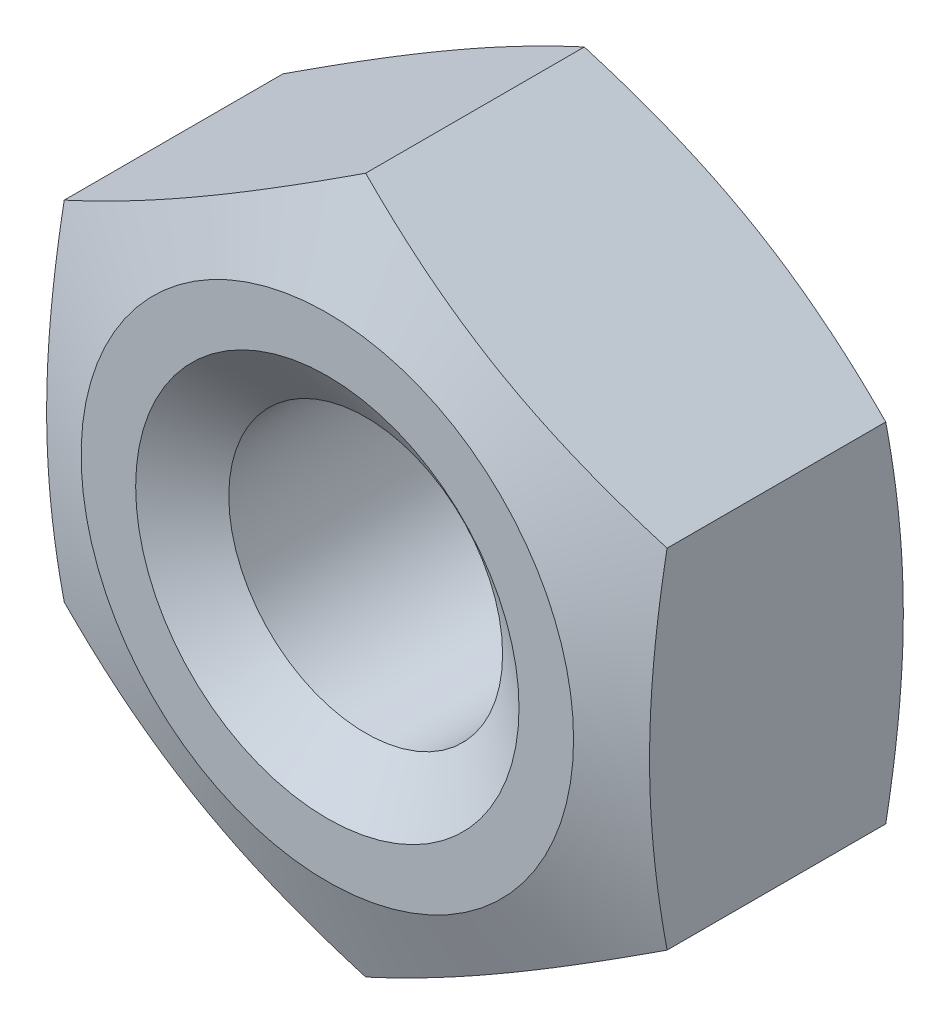
ISO-10303-21;
HEADER;
FILE_DESCRIPTION(('STEP AP214'),'2;1');
FILE_NAME('part.step','',(''),(''),'','','');
FILE_SCHEMA(('AUTOMOTIVE_DESIGN { 1 0 10303 214 1 1 1 1 }'));
ENDSEC;
DATA;
#1=APPLICATION_CONTEXT('core data for automotive mechanical design processes');
#2=APPLICATION_PROTOCOL_DEFINITION('international standard','automotive_design',2000,#1);
#3=PRODUCT_CONTEXT('',#1,'mechanical');
#4=PRODUCT('Part','Part','',(#3));
#5=PRODUCT_RELATED_PRODUCT_CATEGORY('part','',(#4));
#6=PRODUCT_DEFINITION_FORMATION('','',#4);
#7=PRODUCT_DEFINITION_CONTEXT('part definition',#1,'design');
#8=PRODUCT_DEFINITION('design','',#6,#7);
#9=PRODUCT_DEFINITION_SHAPE('','',#8);
#10=(LENGTH_UNIT() NAMED_UNIT(*) SI_UNIT(.MILLI.,.METRE.));
#11=(NAMED_UNIT(*) PLANE_ANGLE_UNIT() SI_UNIT($,.RADIAN.));
#12=(NAMED_UNIT(*) SI_UNIT($,.STERADIAN.) SOLID_ANGLE_UNIT());
#13=UNCERTAINTY_MEASURE_WITH_UNIT(LENGTH_MEASURE(1.E-05),#10,'distance_accuracy_value','');
#14=(GEOMETRIC_REPRESENTATION_CONTEXT(3) GLOBAL_UNCERTAINTY_ASSIGNED_CONTEXT((#13)) GLOBAL_UNIT_ASSIGNED_CONTEXT((#10,
#11,#12)) REPRESENTATION_CONTEXT('',''));
#15=CARTESIAN_POINT('',(0.,0.,0.));
#16=DIRECTION('',(0.,0.,1.));
#17=DIRECTION('',(1.,0.,0.));
#18=AXIS2_PLACEMENT_3D('',#15,#16,#17);
#19=CARTESIAN_POINT('',(0.,0.,-8.5598));
#20=DIRECTION('',(0.,0.,1.));
#21=DIRECTION('',(1.,0.,0.));
#22=AXIS2_PLACEMENT_3D('',#19,#20,#21);
#23=CYLINDRICAL_SURFACE('',#22,3.96875);
#24=CARTESIAN_POINT('',(0.,0.,-1.11157946690792));
#25=DIRECTION('',(0.,0.,1.));
#26=DIRECTION('',(1.,0.,0.));
#27=AXIS2_PLACEMENT_3D('',#24,#25,#26);
#28=CIRCLE('',#27,3.96875);
#29=CARTESIAN_POINT('',(3.96875,0.,-1.11157946690792));
#30=VERTEX_POINT('',#29);
#31=EDGE_CURVE('E123',#30,#30,#28,.F.);
#32=ORIENTED_EDGE('',*,*,#31,.F.);
#33=EDGE_LOOP('',(#32));
#34=FACE_BOUND('',#33,.T.);
#35=CARTESIAN_POINT('',(0.,0.,-7.42282053309208));
#36=DIRECTION('',(0.,0.,-1.));
#37=DIRECTION('',(-1.,0.,0.));
#38=AXIS2_PLACEMENT_3D('',#35,#36,#37);
#39=CIRCLE('',#38,3.96875);
#40=CARTESIAN_POINT('',(-3.96875,0.,-7.42282053309208));
#41=VERTEX_POINT('',#40);
#42=EDGE_CURVE('E39',#41,#41,#39,.F.);
#43=ORIENTED_EDGE('',*,*,#42,.F.);
#44=EDGE_LOOP('',(#43));
#45=FACE_BOUND('',#44,.T.);
#46=ADVANCED_FACE('F34',(#34,#45),#23,.F.);
#47=CARTESIAN_POINT('',(0.,10.0893114241426,-8.5598));
#48=DIRECTION('',(-0.500000000000003,0.866025403784437,0.));
#49=DIRECTION('',(-0.866025403784437,-0.500000000000003,0.));
#50=AXIS2_PLACEMENT_3D('',#47,#48,#49);
#51=PLANE('',#50);
#52=DIRECTION('',(0.,0.,1.));
#53=VECTOR('',#52,1.);
#54=CARTESIAN_POINT('',(-8.7376,5.04465571207126,-8.5598));
#55=LINE('',#54,#53);
#56=CARTESIAN_POINT('',(-8.7376,5.04465571207129,-7.44855));
#57=VERTEX_POINT('',#56);
#58=CARTESIAN_POINT('',(-8.7376,5.04465571207126,-1.11124999999999));
#59=VERTEX_POINT('',#58);
#60=EDGE_CURVE('E119',#57,#59,#55,.T.);
#61=ORIENTED_EDGE('',*,*,#60,.T.);
#62=CARTESIAN_POINT('',(-8.7378,5.04454024201742,-1.11129346956317));
#63=CARTESIAN_POINT('',(-8.37609211156759,5.25337238877189,-1.03265050846831));
#64=CARTESIAN_POINT('',(-8.01311107870638,5.46293958580503,-0.961089398049218));
#65=CARTESIAN_POINT('',(-7.28462512282098,5.88353114853634,-0.835162229363436));
#66=CARTESIAN_POINT('',(-6.91911833686406,6.0945565897992,-0.780810656247587));
#67=CARTESIAN_POINT('',(-6.1899147499906,6.51556247697463,-0.692922643471257));
#68=CARTESIAN_POINT('',(-5.82623698265646,6.72553193384329,-0.659181412508933));
#69=CARTESIAN_POINT('',(-5.09797252564248,7.14599561414154,-0.61392302307191));
#70=CARTESIAN_POINT('',(-4.73338626282125,7.35648959112422,-0.602396886118126));
#71=CARTESIAN_POINT('',(-4.00421373717877,7.77747754508959,-0.602396886118126));
#72=CARTESIAN_POINT('',(-3.63962747435754,7.98797152207227,-0.613923023071912));
#73=CARTESIAN_POINT('',(-2.91136301734356,8.40843520237053,-0.659181412508936));
#74=CARTESIAN_POINT('',(-2.54768525000942,8.61840465923918,-0.692922643471259));
#75=CARTESIAN_POINT('',(-1.81848166313596,9.03941054641462,-0.780810656247591));
#76=CARTESIAN_POINT('',(-1.45297487717904,9.25043598767748,-0.835162229363441));
#77=CARTESIAN_POINT('',(-0.724488921293638,9.67102755040878,-0.961089398049224));
#78=CARTESIAN_POINT('',(-0.361507888432434,9.88059474744193,-1.03265050846832));
#79=CARTESIAN_POINT('',(0.000199999999977429,10.0894268941964,-1.11129346956317));
#80=B_SPLINE_CURVE_WITH_KNOTS('',3,(#62,#63,#64,#65,#66,#67,#68,#69,#70,#71,#72,#73,#74,#75,#76,
#77,#78,#79),.UNSPECIFIED.,.F.,.F.,(4,2,2,2,2,2,2,2,4),(0.,1.27515320459534,2.55137686135804,
3.81470400147829,5.07752044662723,6.34033689177617,7.60366403189642,8.87988768865911,
10.1550408932545),.UNSPECIFIED.);
#81=CARTESIAN_POINT('',(0.,10.0893114241426,-1.11125));
#82=VERTEX_POINT('',#81);
#83=EDGE_CURVE('E52',#59,#82,#80,.T.);
#84=ORIENTED_EDGE('',*,*,#83,.T.);
#85=DIRECTION('',(0.,0.,1.));
#86=VECTOR('',#85,1.);
#87=CARTESIAN_POINT('',(0.,10.0893114241426,-8.5598));
#88=LINE('',#87,#86);
#89=CARTESIAN_POINT('',(0.,10.0893114241426,-7.44855));
#90=VERTEX_POINT('',#89);
#91=EDGE_CURVE('E11',#90,#82,#88,.T.);
#92=ORIENTED_EDGE('',*,*,#91,.F.);
#93=CARTESIAN_POINT('',(-8.7378,5.04454024201742,-7.44850653043684));
#94=CARTESIAN_POINT('',(-8.37609211156759,5.25337238877189,-7.52714949153169));
#95=CARTESIAN_POINT('',(-8.01311107870639,5.46293958580503,-7.59871060195078));
#96=CARTESIAN_POINT('',(-7.28462512282098,5.88353114853633,-7.72463777063656));
#97=CARTESIAN_POINT('',(-6.91911833686406,6.0945565897992,-7.77898934375241));
#98=CARTESIAN_POINT('',(-6.1899147499906,6.51556247697463,-7.86687735652874));
#99=CARTESIAN_POINT('',(-5.82623698265646,6.72553193384329,-7.90061858749107));
#100=CARTESIAN_POINT('',(-5.09797252564248,7.14599561414154,-7.94587697692809));
#101=CARTESIAN_POINT('',(-4.73338626282125,7.35648959112422,-7.95740311388187));
#102=CARTESIAN_POINT('',(-4.00421373717877,7.77747754508959,-7.95740311388187));
#103=CARTESIAN_POINT('',(-3.63962747435754,7.98797152207227,-7.94587697692809));
#104=CARTESIAN_POINT('',(-2.91136301734356,8.40843520237053,-7.90061858749106));
#105=CARTESIAN_POINT('',(-2.54768525000942,8.61840465923918,-7.86687735652874));
#106=CARTESIAN_POINT('',(-1.81848166313596,9.03941054641462,-7.77898934375241));
#107=CARTESIAN_POINT('',(-1.45297487717904,9.25043598767748,-7.72463777063656));
#108=CARTESIAN_POINT('',(-0.724488921293638,9.67102755040878,-7.59871060195078));
#109=CARTESIAN_POINT('',(-0.361507888432435,9.88059474744193,-7.52714949153168));
#110=CARTESIAN_POINT('',(0.000199999999977324,10.0894268941964,-7.44850653043683));
#111=B_SPLINE_CURVE_WITH_KNOTS('',3,(#93,#94,#95,#96,#97,#98,#99,#100,#101,#102,#103,#104,#105,
#106,#107,#108,#109,#110),.UNSPECIFIED.,.F.,.F.,(4,2,2,2,2,2,2,2,4),(0.,1.27515320459534,
2.55137686135804,3.81470400147829,5.07752044662723,6.34033689177617,7.60366403189642,
8.87988768865911,10.1550408932545),.UNSPECIFIED.);
#112=EDGE_CURVE('E122',#57,#90,#111,.T.);
#113=ORIENTED_EDGE('',*,*,#112,.F.);
#114=EDGE_LOOP('',(#61,#84,#92,#113));
#115=FACE_BOUND('',#114,.T.);
#116=ADVANCED_FACE('F36',(#115),#51,.T.);
#117=CARTESIAN_POINT('',(8.73759999999998,5.04465571207129,-8.5598));
#118=DIRECTION('',(0.5,0.866025403784439,0.));
#119=DIRECTION('',(-0.866025403784439,0.5,0.));
#120=AXIS2_PLACEMENT_3D('',#117,#118,#119);
#121=PLANE('',#120);
#122=ORIENTED_EDGE('',*,*,#91,.T.);
#123=CARTESIAN_POINT('',(-0.000200000000020275,10.0894268941964,-1.11129346956317));
#124=CARTESIAN_POINT('',(0.361507888432393,9.88059474744193,-1.03265050846832));
#125=CARTESIAN_POINT('',(0.724488921293597,9.67102755040879,-0.961089398049224));
#126=CARTESIAN_POINT('',(1.452974877179,9.25043598767749,-0.835162229363441));
#127=CARTESIAN_POINT('',(1.81848166313592,9.03941054641463,-0.780810656247591));
#128=CARTESIAN_POINT('',(2.54768525000938,8.61840465923919,-0.69292264347126));
#129=CARTESIAN_POINT('',(2.91136301734353,8.40843520237054,-0.659181412508935));
#130=CARTESIAN_POINT('',(3.6396274743575,7.98797152207229,-0.613923023071912));
#131=CARTESIAN_POINT('',(4.00421373717874,7.7774775450896,-0.602396886118126));
#132=CARTESIAN_POINT('',(4.73338626282121,7.35648959112424,-0.602396886118126));
#133=CARTESIAN_POINT('',(5.09797252564245,7.14599561414156,-0.61392302307191));
#134=CARTESIAN_POINT('',(5.82623698265643,6.72553193384331,-0.659181412508933));
#135=CARTESIAN_POINT('',(6.18991474999057,6.51556247697466,-0.692922643471256));
#136=CARTESIAN_POINT('',(6.91911833686404,6.09455658979922,-0.780810656247586));
#137=CARTESIAN_POINT('',(7.28462512282095,5.88353114853636,-0.835162229363435));
#138=CARTESIAN_POINT('',(8.01311107870636,5.46293958580506,-0.961089398049218));
#139=CARTESIAN_POINT('',(8.37609211156756,5.25337238877192,-1.03265050846831));
#140=CARTESIAN_POINT('',(8.73779999999998,5.04454024201745,-1.11129346956316));
#141=B_SPLINE_CURVE_WITH_KNOTS('',3,(#123,#124,#125,#126,#127,#128,#129,#130,#131,#132,#133,
#134,#135,#136,#137,#138,#139,#140),.UNSPECIFIED.,.F.,.F.,(4,2,2,2,2,2,2,2,4),(0.,
1.27515320459534,2.55137686135804,3.81470400147829,5.07752044662723,6.34033689177617,
7.60366403189642,8.87988768865912,10.1550408932545),.UNSPECIFIED.);
#142=CARTESIAN_POINT('',(8.73759999999998,5.04465571207133,-1.11125));
#143=VERTEX_POINT('',#142);
#144=EDGE_CURVE('E91',#82,#143,#141,.T.);
#145=ORIENTED_EDGE('',*,*,#144,.T.);
#146=DIRECTION('',(0.,0.,1.));
#147=VECTOR('',#146,1.);
#148=CARTESIAN_POINT('',(8.73759999999998,5.04465571207129,-8.5598));
#149=LINE('',#148,#147);
#150=CARTESIAN_POINT('',(8.73759999999998,5.04465571207133,-7.44855));
#151=VERTEX_POINT('',#150);
#152=EDGE_CURVE('E44',#151,#143,#149,.T.);
#153=ORIENTED_EDGE('',*,*,#152,.F.);
#154=CARTESIAN_POINT('',(-0.000200000000020275,10.0894268941964,-7.44850653043683));
#155=CARTESIAN_POINT('',(0.361507888432393,9.88059474744193,-7.52714949153168));
#156=CARTESIAN_POINT('',(0.724488921293597,9.67102755040879,-7.59871060195078));
#157=CARTESIAN_POINT('',(1.452974877179,9.25043598767749,-7.72463777063656));
#158=CARTESIAN_POINT('',(1.81848166313592,9.03941054641463,-7.77898934375241));
#159=CARTESIAN_POINT('',(2.54768525000938,8.61840465923919,-7.86687735652874));
#160=CARTESIAN_POINT('',(2.91136301734353,8.40843520237054,-7.90061858749107));
#161=CARTESIAN_POINT('',(3.6396274743575,7.98797152207229,-7.94587697692809));
#162=CARTESIAN_POINT('',(4.00421373717874,7.7774775450896,-7.95740311388187));
#163=CARTESIAN_POINT('',(4.73338626282121,7.35648959112424,-7.95740311388187));
#164=CARTESIAN_POINT('',(5.09797252564245,7.14599561414156,-7.94587697692809));
#165=CARTESIAN_POINT('',(5.82623698265643,6.72553193384331,-7.90061858749107));
#166=CARTESIAN_POINT('',(6.18991474999057,6.51556247697466,-7.86687735652874));
#167=CARTESIAN_POINT('',(6.91911833686404,6.09455658979922,-7.77898934375241));
#168=CARTESIAN_POINT('',(7.28462512282095,5.88353114853636,-7.72463777063657));
#169=CARTESIAN_POINT('',(8.01311107870636,5.46293958580506,-7.59871060195078));
#170=CARTESIAN_POINT('',(8.37609211156756,5.25337238877192,-7.52714949153169));
#171=CARTESIAN_POINT('',(8.73779999999998,5.04454024201745,-7.44850653043684));
#172=B_SPLINE_CURVE_WITH_KNOTS('',3,(#154,#155,#156,#157,#158,#159,#160,#161,#162,#163,#164,
#165,#166,#167,#168,#169,#170,#171),.UNSPECIFIED.,.F.,.F.,(4,2,2,2,2,2,2,2,4),(0.,
1.27515320459534,2.55137686135804,3.81470400147829,5.07752044662723,6.34033689177617,
7.60366403189642,8.87988768865912,10.1550408932545),.UNSPECIFIED.);
#173=EDGE_CURVE('E196',#90,#151,#172,.T.);
#174=ORIENTED_EDGE('',*,*,#173,.F.);
#175=EDGE_LOOP('',(#122,#145,#153,#174));
#176=FACE_BOUND('',#175,.T.);
#177=ADVANCED_FACE('F101',(#176),#121,.T.);
#178=CARTESIAN_POINT('',(8.73759999999998,5.04465571207129,-8.5598));
#179=DIRECTION('',(-1.,0.,0.));
#180=DIRECTION('',(0.,0.,1.));
#181=AXIS2_PLACEMENT_3D('',#178,#179,#180);
#182=PLANE('',#181);
#183=CARTESIAN_POINT('',(8.73759999999998,-13.2997802863841,-3.30365718708242));
#184=CARTESIAN_POINT('',(8.73759999999998,-12.9053106289544,-3.1795816960487));
#185=CARTESIAN_POINT('',(8.73759999999998,-12.5103760718696,-3.05695696258368));
#186=CARTESIAN_POINT('',(8.73759999999998,-11.7193393515412,-2.81541428543222));
#187=CARTESIAN_POINT('',(8.73759999999998,-11.3232370909826,-2.69649666083266));
#188=CARTESIAN_POINT('',(8.73759999999998,-10.5288789126376,-2.46295518357239));
#189=CARTESIAN_POINT('',(8.73759999999998,-10.1306202411333,-2.3483406631995));
#190=CARTESIAN_POINT('',(8.73759999999998,-9.33251743534681,-2.12478074631059));
#191=CARTESIAN_POINT('',(8.73759999999998,-8.9326733331707,-2.01583523561765));
#192=CARTESIAN_POINT('',(8.73759999999998,-8.13625591199136,-1.80637602810193));
#193=CARTESIAN_POINT('',(8.73759999999998,-7.73970644755138,-1.70577208385183));
#194=CARTESIAN_POINT('',(8.73759999999998,-6.94449552514947,-1.51318829853075));
#195=CARTESIAN_POINT('',(8.73759999999998,-6.545834023913,-1.4212086348945));
#196=CARTESIAN_POINT('',(8.73759999999998,-5.74632708387352,-1.24805060133413));
#197=CARTESIAN_POINT('',(8.73759999999998,-5.34548263091717,-1.16686771846261));
#198=CARTESIAN_POINT('',(8.73759999999998,-4.54131238615193,-1.01780189646545));
#199=CARTESIAN_POINT('',(8.73759999999998,-4.13798670793917,-0.949918353071242));
#200=CARTESIAN_POINT('',(8.73759999999998,-3.38683862733906,-0.838814887976535));
#201=CARTESIAN_POINT('',(8.73759999999998,-3.03933518510973,-0.793455491085336));
#202=CARTESIAN_POINT('',(8.73759999999998,-2.34281542315914,-0.716280277133296));
#203=CARTESIAN_POINT('',(8.73759999999998,-1.99379914638645,-0.684464078099379));
#204=CARTESIAN_POINT('',(8.73759999999998,-1.29494897682985,-0.635813798813064));
#205=CARTESIAN_POINT('',(8.73759999999998,-0.945115809827202,-0.618969448299458));
#206=CARTESIAN_POINT('',(8.73759999999998,-0.245041455906799,-0.601063527708213));
#207=CARTESIAN_POINT('',(8.73759999999998,0.105199728186989,-0.60000184903696));
#208=CARTESIAN_POINT('',(8.73759999999998,0.807175526920782,-0.613751878299873));
#209=CARTESIAN_POINT('',(8.73759999999998,1.15890851030084,-0.628645610809185));
#210=CARTESIAN_POINT('',(8.73759999999998,1.86138875201495,-0.673680396326097));
#211=CARTESIAN_POINT('',(8.73759999999998,2.21213598914105,-0.703821774893415));
#212=CARTESIAN_POINT('',(8.73759999999998,2.91242074182731,-0.777997462813237));
#213=CARTESIAN_POINT('',(8.73759999999998,3.26195706981302,-0.822042830604939));
#214=CARTESIAN_POINT('',(8.73759999999998,3.95926125993478,-0.922290651365243));
#215=CARTESIAN_POINT('',(8.73759999999998,4.30702911801808,-0.978493132181133));
#216=CARTESIAN_POINT('',(8.73759999999998,5.03750758775749,-1.1077636362078));
#217=CARTESIAN_POINT('',(8.73759999999998,5.42001188996424,-1.18198826275341));
#218=CARTESIAN_POINT('',(8.73759999999998,6.18286992161121,-1.34083685808249));
#219=CARTESIAN_POINT('',(8.73759999999998,6.56322344917872,-1.42546178663612));
#220=CARTESIAN_POINT('',(8.73759999999998,7.3220790696213,-1.60317730274161));
#221=CARTESIAN_POINT('',(8.73759999999998,7.70058044647897,-1.69627092778223));
#222=CARTESIAN_POINT('',(8.73759999999998,8.45581949324483,-1.88927767251259));
#223=CARTESIAN_POINT('',(8.73759999999998,8.83255721403487,-1.98919059415229));
#224=CARTESIAN_POINT('',(8.73759999999998,9.58515694868287,-2.19471281035486));
#225=CARTESIAN_POINT('',(8.73759999999998,9.96101639078715,-2.30033148578824));
#226=CARTESIAN_POINT('',(8.73759999999998,10.7114383610788,-2.51607343828337));
#227=CARTESIAN_POINT('',(8.73759999999998,11.086000882602,-2.62619673845463));
#228=CARTESIAN_POINT('',(8.73759999999998,11.8339427742072,-2.85010303704661));
#229=CARTESIAN_POINT('',(8.73759999999998,12.2073223750352,-2.96388526639885));
#230=CARTESIAN_POINT('',(8.73759999999998,12.9531431316127,-3.19448850320963));
#231=CARTESIAN_POINT('',(8.73759999999998,13.3255842802566,-3.31130953360136));
#232=CARTESIAN_POINT('',(8.73759999999998,14.4337975538044,-3.66301871692672));
#233=CARTESIAN_POINT('',(8.73759999999998,15.1684101647458,-3.90155946599758));
#234=CARTESIAN_POINT('',(8.73759999999998,16.6353856117534,-4.38556554618609));
#235=CARTESIAN_POINT('',(8.73759999999998,17.3677483148742,-4.63103127808921));
#236=CARTESIAN_POINT('',(8.73759999999998,18.827362724634,-5.12586081453899));
#237=CARTESIAN_POINT('',(8.73759999999998,19.5546223727919,-5.37520122518771));
#238=CARTESIAN_POINT('',(8.73759999999998,20.6445031573282,-5.75201031200258));
#239=CARTESIAN_POINT('',(8.73759999999998,21.0076114763026,-5.87807372023337));
#240=CARTESIAN_POINT('',(8.73759999999998,21.7335398299974,-6.13102483582787));
#241=CARTESIAN_POINT('',(8.73759999999998,22.0963598654964,-6.25791254095697));
#242=CARTESIAN_POINT('',(8.73759999999998,22.4590549541484,-6.38515658172557));
#243=B_SPLINE_CURVE_WITH_KNOTS('',3,(#183,#184,#185,#186,#187,#188,#189,#190,#191,#192,#193,
#194,#195,#196,#197,#198,#199,#200,#201,#202,#203,#204,#205,#206,#207,#208,#209,#210,#211,#212,
#213,#214,#215,#216,#217,#218,#219,#220,#221,#222,#223,#224,#225,#226,#227,#228,#229,#230,#231,
#232,#233,#234,#235,#236,#237,#238,#239,#240,#241,#242),.UNSPECIFIED.,.F.,.F.,(4,2,2,2,2,2,2,2,
2,2,2,2,2,2,2,2,2,2,2,2,2,2,2,2,2,2,2,2,2,4),(0.,1.24057761613341,2.48126172094946,
3.72449709037798,4.9677074106732,6.19496719785217,7.42225222896299,8.64902264388419,
9.87573730635306,10.9268613577521,11.9779557612276,13.0283285862087,14.0786941840336,
15.1344855953611,16.190299550343,17.2469553642047,18.3036135984857,19.472351710133,
20.6411977574379,21.8104647032084,22.9796977048752,24.1509152999745,25.3221389043779,
26.4931179186077,27.6641057725355,29.9811631727754,32.298354949629,34.60478668035,
35.7578934028574,36.9109970006741),.UNSPECIFIED.);
#244=CARTESIAN_POINT('',(8.73760000000005,-5.04465571207121,-1.11125));
#245=VERTEX_POINT('',#244);
#246=EDGE_CURVE('E88',#245,#143,#243,.T.);
#247=ORIENTED_EDGE('',*,*,#246,.F.);
#248=DIRECTION('',(0.,0.,1.));
#249=VECTOR('',#248,1.);
#250=CARTESIAN_POINT('',(8.73759999999998,-5.04465571207125,-8.5598));
#251=LINE('',#250,#249);
#252=CARTESIAN_POINT('',(8.73760000000005,-5.04465571207121,-7.44855));
#253=VERTEX_POINT('',#252);
#254=EDGE_CURVE('E108',#253,#245,#251,.T.);
#255=ORIENTED_EDGE('',*,*,#254,.F.);
#256=CARTESIAN_POINT('',(8.73759999999998,-13.2997802863841,-5.25614281291758));
#257=CARTESIAN_POINT('',(8.73759999999998,-12.9053106289544,-5.3802183039513));
#258=CARTESIAN_POINT('',(8.73759999999998,-12.5103760718696,-5.50284303741632));
#259=CARTESIAN_POINT('',(8.73759999999998,-11.7193393515412,-5.74438571456778));
#260=CARTESIAN_POINT('',(8.73759999999998,-11.3232370909826,-5.86330333916734));
#261=CARTESIAN_POINT('',(8.73759999999998,-10.5288789126376,-6.09684481642761));
#262=CARTESIAN_POINT('',(8.73759999999998,-10.1306202411333,-6.21145933680051));
#263=CARTESIAN_POINT('',(8.73759999999998,-9.33251743534681,-6.43501925368941));
#264=CARTESIAN_POINT('',(8.73759999999998,-8.9326733331707,-6.54396476438235));
#265=CARTESIAN_POINT('',(8.73759999999998,-8.13625591199136,-6.75342397189807));
#266=CARTESIAN_POINT('',(8.73759999999998,-7.73970644755138,-6.85402791614817));
#267=CARTESIAN_POINT('',(8.73759999999998,-6.94449552514947,-7.04661170146926));
#268=CARTESIAN_POINT('',(8.73759999999998,-6.545834023913,-7.1385913651055));
#269=CARTESIAN_POINT('',(8.73759999999998,-5.74632708387352,-7.31174939866587));
#270=CARTESIAN_POINT('',(8.73759999999998,-5.34548263091717,-7.39293228153739));
#271=CARTESIAN_POINT('',(8.73759999999998,-4.54131238615193,-7.54199810353456));
#272=CARTESIAN_POINT('',(8.73759999999998,-4.13798670793917,-7.60988164692876));
#273=CARTESIAN_POINT('',(8.73759999999998,-3.38683862733906,-7.72098511202347));
#274=CARTESIAN_POINT('',(8.73759999999998,-3.03933518510973,-7.76634450891467));
#275=CARTESIAN_POINT('',(8.73759999999998,-2.34281542315914,-7.8435197228667));
#276=CARTESIAN_POINT('',(8.73759999999998,-1.99379914638645,-7.87533592190062));
#277=CARTESIAN_POINT('',(8.73759999999998,-1.29494897682985,-7.92398620118694));
#278=CARTESIAN_POINT('',(8.73759999999998,-0.945115809827204,-7.94083055170054));
#279=CARTESIAN_POINT('',(8.73759999999998,-0.245041455906801,-7.95873647229179));
#280=CARTESIAN_POINT('',(8.73759999999998,0.105199728186986,-7.95979815096304));
#281=CARTESIAN_POINT('',(8.73759999999998,0.807175526920778,-7.94604812170013));
#282=CARTESIAN_POINT('',(8.73759999999998,1.15890851030084,-7.93115438919081));
#283=CARTESIAN_POINT('',(8.73759999999998,1.86138875201494,-7.8861196036739));
#284=CARTESIAN_POINT('',(8.73759999999998,2.21213598914105,-7.85597822510659));
#285=CARTESIAN_POINT('',(8.73759999999998,2.91242074182731,-7.78180253718677));
#286=CARTESIAN_POINT('',(8.73759999999998,3.26195706981302,-7.73775716939506));
#287=CARTESIAN_POINT('',(8.73759999999998,3.95926125993478,-7.63750934863476));
#288=CARTESIAN_POINT('',(8.73759999999998,4.30702911801808,-7.58130686781887));
#289=CARTESIAN_POINT('',(8.73759999999998,5.03750758775749,-7.4520363637922));
#290=CARTESIAN_POINT('',(8.73759999999998,5.42001188996424,-7.37781173724659));
#291=CARTESIAN_POINT('',(8.73759999999998,6.18286992161121,-7.21896314191751));
#292=CARTESIAN_POINT('',(8.73759999999998,6.56322344917872,-7.13433821336388));
#293=CARTESIAN_POINT('',(8.73759999999998,7.3220790696213,-6.9566226972584));
#294=CARTESIAN_POINT('',(8.73759999999998,7.70058044647898,-6.86352907221777));
#295=CARTESIAN_POINT('',(8.73759999999998,8.45581949324484,-6.67052232748741));
#296=CARTESIAN_POINT('',(8.73759999999998,8.83255721403488,-6.57060940584771));
#297=CARTESIAN_POINT('',(8.73759999999998,9.58515694868287,-6.36508718964514));
#298=CARTESIAN_POINT('',(8.73759999999998,9.96101639078715,-6.25946851421176));
#299=CARTESIAN_POINT('',(8.73759999999998,10.7114383610788,-6.04372656171663));
#300=CARTESIAN_POINT('',(8.73759999999998,11.086000882602,-5.93360326154537));
#301=CARTESIAN_POINT('',(8.73759999999998,11.8339427742072,-5.70969696295338));
#302=CARTESIAN_POINT('',(8.73759999999998,12.2073223750352,-5.59591473360115));
#303=CARTESIAN_POINT('',(8.73759999999998,12.9531431316127,-5.36531149679037));
#304=CARTESIAN_POINT('',(8.73759999999998,13.3255842802566,-5.24849046639864));
#305=CARTESIAN_POINT('',(8.73759999999998,14.4337975538044,-4.89678128307328));
#306=CARTESIAN_POINT('',(8.73759999999998,15.1684101647458,-4.65824053400242));
#307=CARTESIAN_POINT('',(8.73759999999998,16.6353856117534,-4.17423445381391));
#308=CARTESIAN_POINT('',(8.73759999999998,17.3677483148742,-3.92876872191079));
#309=CARTESIAN_POINT('',(8.73759999999998,18.827362724634,-3.43393918546101));
#310=CARTESIAN_POINT('',(8.73759999999998,19.5546223727919,-3.18459877481229));
#311=CARTESIAN_POINT('',(8.73759999999998,20.6445031573282,-2.80778968799742));
#312=CARTESIAN_POINT('',(8.73759999999998,21.0076114763026,-2.68172627976662));
#313=CARTESIAN_POINT('',(8.73759999999998,21.7335398299974,-2.42877516417213));
#314=CARTESIAN_POINT('',(8.73759999999998,22.0963598654964,-2.30188745904303));
#315=CARTESIAN_POINT('',(8.73759999999998,22.4590549541484,-2.17464341827443));
#316=B_SPLINE_CURVE_WITH_KNOTS('',3,(#256,#257,#258,#259,#260,#261,#262,#263,#264,#265,#266,
#267,#268,#269,#270,#271,#272,#273,#274,#275,#276,#277,#278,#279,#280,#281,#282,#283,#284,#285,
#286,#287,#288,#289,#290,#291,#292,#293,#294,#295,#296,#297,#298,#299,#300,#301,#302,#303,#304,
#305,#306,#307,#308,#309,#310,#311,#312,#313,#314,#315),.UNSPECIFIED.,.F.,.F.,(4,2,2,2,2,2,2,2,
2,2,2,2,2,2,2,2,2,2,2,2,2,2,2,2,2,2,2,2,2,4),(0.,1.24057761613341,2.48126172094946,
3.72449709037798,4.9677074106732,6.19496719785218,7.422252228963,8.64902264388419,
9.87573730635306,10.9268613577521,11.9779557612276,13.0283285862087,14.0786941840336,
15.1344855953611,16.190299550343,17.2469553642047,18.3036135984857,19.472351710133,
20.6411977574379,21.8104647032084,22.9796977048752,24.1509152999745,25.3221389043779,
26.4931179186078,27.6641057725355,29.9811631727754,32.298354949629,34.60478668035,
35.7578934028574,36.9109970006741),.UNSPECIFIED.);
#317=EDGE_CURVE('E107',#253,#151,#316,.T.);
#318=ORIENTED_EDGE('',*,*,#317,.T.);
#319=ORIENTED_EDGE('',*,*,#152,.T.);
#320=EDGE_LOOP('',(#247,#255,#318,#319));
#321=FACE_BOUND('',#320,.T.);
#322=ADVANCED_FACE('F106',(#321),#182,.F.);
#323=CARTESIAN_POINT('',(0.,-10.0893114241425,-8.5598));
#324=DIRECTION('',(0.500000000000002,-0.866025403784437,0.));
#325=DIRECTION('',(0.866025403784437,0.500000000000002,0.));
#326=AXIS2_PLACEMENT_3D('',#323,#324,#325);
#327=PLANE('',#326);
#328=ORIENTED_EDGE('',*,*,#254,.T.);
#329=CARTESIAN_POINT('',(8.73779999999998,-5.04454024201741,-1.11129346956316));
#330=CARTESIAN_POINT('',(8.37609211156756,-5.25337238877187,-1.0326505084683));
#331=CARTESIAN_POINT('',(8.01311107870636,-5.46293958580502,-0.961089398049208));
#332=CARTESIAN_POINT('',(7.28462512282095,-5.88353114853633,-0.835162229363426));
#333=CARTESIAN_POINT('',(6.91911833686404,-6.09455658979919,-0.780810656247578));
#334=CARTESIAN_POINT('',(6.18991474999058,-6.51556247697462,-0.692922643471248));
#335=CARTESIAN_POINT('',(5.82623698265643,-6.72553193384327,-0.659181412508924));
#336=CARTESIAN_POINT('',(5.09797252564246,-7.14599561414153,-0.613923023071902));
#337=CARTESIAN_POINT('',(4.73338626282122,-7.35648959112421,-0.602396886118117));
#338=CARTESIAN_POINT('',(4.00421373717875,-7.77747754508958,-0.602396886118118));
#339=CARTESIAN_POINT('',(3.63962747435751,-7.98797152207226,-0.613923023071904));
#340=CARTESIAN_POINT('',(2.91136301734354,-8.40843520237051,-0.659181412508928));
#341=CARTESIAN_POINT('',(2.5476852500094,-8.61840465923917,-0.692922643471252));
#342=CARTESIAN_POINT('',(1.81848166313593,-9.0394105464146,-0.780810656247584));
#343=CARTESIAN_POINT('',(1.45297487717902,-9.25043598767746,-0.835162229363434));
#344=CARTESIAN_POINT('',(0.724488921293612,-9.67102755040877,-0.961089398049218));
#345=CARTESIAN_POINT('',(0.361507888432409,-9.88059474744191,-1.03265050846831));
#346=CARTESIAN_POINT('',(-0.00020000000000348,-10.0894268941964,-1.11129346956317));
#347=B_SPLINE_CURVE_WITH_KNOTS('',3,(#329,#330,#331,#332,#333,#334,#335,#336,#337,#338,#339,
#340,#341,#342,#343,#344,#345,#346),.UNSPECIFIED.,.F.,.F.,(4,2,2,2,2,2,2,2,4),(0.,
1.27515320459535,2.55137686135804,3.81470400147829,5.07752044662723,6.34033689177617,
7.60366403189642,8.87988768865912,10.1550408932545),.UNSPECIFIED.);
#348=CARTESIAN_POINT('',(0.,-10.0893114241426,-1.11125));
#349=VERTEX_POINT('',#348);
#350=EDGE_CURVE('E93',#245,#349,#347,.T.);
#351=ORIENTED_EDGE('',*,*,#350,.T.);
#352=DIRECTION('',(0.,0.,1.));
#353=VECTOR('',#352,1.);
#354=CARTESIAN_POINT('',(0.,-10.0893114241425,-8.5598));
#355=LINE('',#354,#353);
#356=CARTESIAN_POINT('',(0.,-10.0893114241426,-7.44855));
#357=VERTEX_POINT('',#356);
#358=EDGE_CURVE('E110',#357,#349,#355,.T.);
#359=ORIENTED_EDGE('',*,*,#358,.F.);
#360=CARTESIAN_POINT('',(8.73779999999998,-5.04454024201741,-7.44850653043685));
#361=CARTESIAN_POINT('',(8.37609211156756,-5.25337238877187,-7.5271494915317));
#362=CARTESIAN_POINT('',(8.01311107870636,-5.46293958580502,-7.59871060195079));
#363=CARTESIAN_POINT('',(7.28462512282095,-5.88353114853633,-7.72463777063657));
#364=CARTESIAN_POINT('',(6.91911833686404,-6.09455658979919,-7.77898934375242));
#365=CARTESIAN_POINT('',(6.18991474999058,-6.51556247697462,-7.86687735652875));
#366=CARTESIAN_POINT('',(5.82623698265643,-6.72553193384327,-7.90061858749108));
#367=CARTESIAN_POINT('',(5.09797252564246,-7.14599561414153,-7.9458769769281));
#368=CARTESIAN_POINT('',(4.73338626282122,-7.35648959112421,-7.95740311388188));
#369=CARTESIAN_POINT('',(4.00421373717875,-7.77747754508958,-7.95740311388188));
#370=CARTESIAN_POINT('',(3.63962747435751,-7.98797152207226,-7.9458769769281));
#371=CARTESIAN_POINT('',(2.91136301734354,-8.40843520237051,-7.90061858749107));
#372=CARTESIAN_POINT('',(2.5476852500094,-8.61840465923917,-7.86687735652875));
#373=CARTESIAN_POINT('',(1.81848166313593,-9.0394105464146,-7.77898934375242));
#374=CARTESIAN_POINT('',(1.45297487717902,-9.25043598767746,-7.72463777063657));
#375=CARTESIAN_POINT('',(0.724488921293612,-9.67102755040877,-7.59871060195078));
#376=CARTESIAN_POINT('',(0.361507888432408,-9.88059474744191,-7.52714949153169));
#377=CARTESIAN_POINT('',(-0.000200000000003476,-10.0894268941964,-7.44850653043683));
#378=B_SPLINE_CURVE_WITH_KNOTS('',3,(#360,#361,#362,#363,#364,#365,#366,#367,#368,#369,#370,
#371,#372,#373,#374,#375,#376,#377),.UNSPECIFIED.,.F.,.F.,(4,2,2,2,2,2,2,2,4),(0.,
1.27515320459535,2.55137686135804,3.81470400147829,5.07752044662723,6.34033689177617,
7.60366403189642,8.87988768865912,10.1550408932545),.UNSPECIFIED.);
#379=EDGE_CURVE('E224',#253,#357,#378,.T.);
#380=ORIENTED_EDGE('',*,*,#379,.F.);
#381=EDGE_LOOP('',(#328,#351,#359,#380));
#382=FACE_BOUND('',#381,.T.);
#383=ADVANCED_FACE('F231',(#382),#327,.T.);
#384=CARTESIAN_POINT('',(-8.7376,-5.04465571207128,-8.5598));
#385=DIRECTION('',(-0.499999999999999,-0.866025403784439,0.));
#386=DIRECTION('',(0.866025403784439,-0.499999999999999,0.));
#387=AXIS2_PLACEMENT_3D('',#384,#385,#386);
#388=PLANE('',#387);
#389=ORIENTED_EDGE('',*,*,#358,.T.);
#390=CARTESIAN_POINT('',(0.000199999999996928,-10.0894268941964,-1.11129346956317));
#391=CARTESIAN_POINT('',(-0.361507888432415,-9.88059474744191,-1.03265050846832));
#392=CARTESIAN_POINT('',(-0.724488921293619,-9.67102755040877,-0.961089398049219));
#393=CARTESIAN_POINT('',(-1.45297487717902,-9.25043598767747,-0.835162229363437));
#394=CARTESIAN_POINT('',(-1.81848166313594,-9.03941054641461,-0.780810656247587));
#395=CARTESIAN_POINT('',(-2.54768525000941,-8.61840465923918,-0.692922643471256));
#396=CARTESIAN_POINT('',(-2.91136301734355,-8.40843520237052,-0.659181412508933));
#397=CARTESIAN_POINT('',(-3.63962747435753,-7.98797152207227,-0.61392302307191));
#398=CARTESIAN_POINT('',(-4.00421373717876,-7.77747754508959,-0.602396886118126));
#399=CARTESIAN_POINT('',(-4.73338626282124,-7.35648959112423,-0.602396886118126));
#400=CARTESIAN_POINT('',(-5.09797252564248,-7.14599561414155,-0.613923023071911));
#401=CARTESIAN_POINT('',(-5.82623698265645,-6.7255319338433,-0.659181412508934));
#402=CARTESIAN_POINT('',(-6.1899147499906,-6.51556247697464,-0.692922643471258));
#403=CARTESIAN_POINT('',(-6.91911833686406,-6.09455658979921,-0.78081065624759));
#404=CARTESIAN_POINT('',(-7.28462512282098,-5.88353114853635,-0.835162229363439));
#405=CARTESIAN_POINT('',(-8.01311107870639,-5.46293958580505,-0.961089398049222));
#406=CARTESIAN_POINT('',(-8.37609211156759,-5.2533723887719,-1.03265050846832));
#407=CARTESIAN_POINT('',(-8.7378,-5.04454024201744,-1.11129346956317));
#408=B_SPLINE_CURVE_WITH_KNOTS('',3,(#390,#391,#392,#393,#394,#395,#396,#397,#398,#399,#400,
#401,#402,#403,#404,#405,#406,#407),.UNSPECIFIED.,.F.,.F.,(4,2,2,2,2,2,2,2,4),(0.,
1.27515320459534,2.55137686135804,3.81470400147829,5.07752044662723,6.34033689177617,
7.60366403189642,8.87988768865912,10.1550408932545),.UNSPECIFIED.);
#409=CARTESIAN_POINT('',(-8.7376,-5.04465571207129,-1.11125));
#410=VERTEX_POINT('',#409);
#411=EDGE_CURVE('E148',#349,#410,#408,.T.);
#412=ORIENTED_EDGE('',*,*,#411,.T.);
#413=DIRECTION('',(0.,0.,1.));
#414=VECTOR('',#413,1.);
#415=CARTESIAN_POINT('',(-8.7376,-5.04465571207128,-8.5598));
#416=LINE('',#415,#414);
#417=CARTESIAN_POINT('',(-8.7376,-5.04465571207128,-7.44855));
#418=VERTEX_POINT('',#417);
#419=EDGE_CURVE('E116',#418,#410,#416,.T.);
#420=ORIENTED_EDGE('',*,*,#419,.F.);
#421=CARTESIAN_POINT('',(0.000199999999996964,-10.0894268941964,-7.44850653043683));
#422=CARTESIAN_POINT('',(-0.361507888432415,-9.88059474744191,-7.52714949153169));
#423=CARTESIAN_POINT('',(-0.724488921293619,-9.67102755040877,-7.59871060195078));
#424=CARTESIAN_POINT('',(-1.45297487717902,-9.25043598767747,-7.72463777063656));
#425=CARTESIAN_POINT('',(-1.81848166313594,-9.03941054641461,-7.77898934375241));
#426=CARTESIAN_POINT('',(-2.54768525000941,-8.61840465923918,-7.86687735652874));
#427=CARTESIAN_POINT('',(-2.91136301734355,-8.40843520237052,-7.90061858749107));
#428=CARTESIAN_POINT('',(-3.63962747435753,-7.98797152207227,-7.94587697692809));
#429=CARTESIAN_POINT('',(-4.00421373717876,-7.77747754508959,-7.95740311388187));
#430=CARTESIAN_POINT('',(-4.73338626282124,-7.35648959112423,-7.95740311388187));
#431=CARTESIAN_POINT('',(-5.09797252564248,-7.14599561414155,-7.94587697692809));
#432=CARTESIAN_POINT('',(-5.82623698265645,-6.7255319338433,-7.90061858749107));
#433=CARTESIAN_POINT('',(-6.1899147499906,-6.51556247697464,-7.86687735652874));
#434=CARTESIAN_POINT('',(-6.91911833686406,-6.09455658979921,-7.77898934375241));
#435=CARTESIAN_POINT('',(-7.28462512282098,-5.88353114853635,-7.72463777063656));
#436=CARTESIAN_POINT('',(-8.01311107870639,-5.46293958580505,-7.59871060195078));
#437=CARTESIAN_POINT('',(-8.37609211156759,-5.2533723887719,-7.52714949153168));
#438=CARTESIAN_POINT('',(-8.7378,-5.04454024201744,-7.44850653043683));
#439=B_SPLINE_CURVE_WITH_KNOTS('',3,(#421,#422,#423,#424,#425,#426,#427,#428,#429,#430,#431,
#432,#433,#434,#435,#436,#437,#438),.UNSPECIFIED.,.F.,.F.,(4,2,2,2,2,2,2,2,4),(0.,
1.27515320459534,2.55137686135804,3.81470400147829,5.07752044662723,6.34033689177617,
7.60366403189642,8.87988768865912,10.1550408932545),.UNSPECIFIED.);
#440=EDGE_CURVE('E60',#357,#418,#439,.T.);
#441=ORIENTED_EDGE('',*,*,#440,.F.);
#442=EDGE_LOOP('',(#389,#412,#420,#441));
#443=FACE_BOUND('',#442,.T.);
#444=ADVANCED_FACE('F228',(#443),#388,.T.);
#445=CARTESIAN_POINT('',(-8.7376,5.04465571207126,-8.5598));
#446=DIRECTION('',(-1.,0.,0.));
#447=DIRECTION('',(0.,-1.,0.));
#448=AXIS2_PLACEMENT_3D('',#445,#446,#447);
#449=PLANE('',#448);
#450=ORIENTED_EDGE('',*,*,#419,.T.);
#451=CARTESIAN_POINT('',(-8.7376,-13.2997802864013,-3.30365718708784));
#452=CARTESIAN_POINT('',(-8.7376,-12.9053106289709,-3.17958169605387));
#453=CARTESIAN_POINT('',(-8.7376,-12.5103760718855,-3.05695696258859));
#454=CARTESIAN_POINT('',(-8.7376,-11.7193393515558,-2.81541428543662));
#455=CARTESIAN_POINT('',(-8.7376,-11.3232370909965,-2.69649666083681));
#456=CARTESIAN_POINT('',(-8.7376,-10.5288789126502,-2.46295518357604));
#457=CARTESIAN_POINT('',(-8.7376,-10.1306202411452,-2.34834066320289));
#458=CARTESIAN_POINT('',(-8.7376,-9.33251743535736,-2.1247807463135));
#459=CARTESIAN_POINT('',(-8.7376,-8.93267333318058,-2.01583523562032));
#460=CARTESIAN_POINT('',(-8.7376,-8.1362559119999,-1.80637602810413));
#461=CARTESIAN_POINT('',(-8.7376,-7.73970644755925,-1.7057720838538));
#462=CARTESIAN_POINT('',(-8.7376,-6.944495525156,-1.51318829853228));
#463=CARTESIAN_POINT('',(-8.7376,-6.54583402391885,-1.42120863489583));
#464=CARTESIAN_POINT('',(-8.7376,-5.74632708387802,-1.24805060133506));
#465=CARTESIAN_POINT('',(-8.7376,-5.34548263092098,-1.16686771846336));
#466=CARTESIAN_POINT('',(-8.7376,-4.54131238615438,-1.01780189646587));
#467=CARTESIAN_POINT('',(-8.7376,-4.13798670794093,-0.949918353071525));
#468=CARTESIAN_POINT('',(-8.7376,-3.38683862734028,-0.838814887976711));
#469=CARTESIAN_POINT('',(-8.7376,-3.03933518511111,-0.793455491085517));
#470=CARTESIAN_POINT('',(-8.7376,-2.34281542316084,-0.716280277133473));
#471=CARTESIAN_POINT('',(-8.7376,-1.9937991463883,-0.684464078099546));
#472=CARTESIAN_POINT('',(-8.7376,-1.29494897683201,-0.635813798813195));
#473=CARTESIAN_POINT('',(-8.7376,-0.945115809829523,-0.618969448299564));
#474=CARTESIAN_POINT('',(-8.7376,-0.24504145590943,-0.601063527708253));
#475=CARTESIAN_POINT('',(-8.7376,0.105199728184202,-0.600001849036958));
#476=CARTESIAN_POINT('',(-8.7376,0.80717552691768,-0.613751878299777));
#477=CARTESIAN_POINT('',(-8.7376,1.15890851029758,-0.628645610809035));
#478=CARTESIAN_POINT('',(-8.7376,1.86138875201137,-0.673680396325827));
#479=CARTESIAN_POINT('',(-8.7376,2.21213598913732,-0.703821774893081));
#480=CARTESIAN_POINT('',(-8.7376,2.91242074182327,-0.777997462812764));
#481=CARTESIAN_POINT('',(-8.7376,3.26195706980883,-0.822042830604394));
#482=CARTESIAN_POINT('',(-8.7376,3.95926125993028,-0.922290651364551));
#483=CARTESIAN_POINT('',(-8.7376,4.30702911801342,-0.978493132180366));
#484=CARTESIAN_POINT('',(-8.7376,5.03750758775269,-1.1077636362069));
#485=CARTESIAN_POINT('',(-8.7376,5.42001188995943,-1.18198826275246));
#486=CARTESIAN_POINT('',(-8.7376,6.1828699216064,-1.34083685808145));
#487=CARTESIAN_POINT('',(-8.7376,6.56322344917391,-1.42546178663504));
#488=CARTESIAN_POINT('',(-8.7376,7.32207906961648,-1.60317730274045));
#489=CARTESIAN_POINT('',(-8.7376,7.70058044647416,-1.69627092778104));
#490=CARTESIAN_POINT('',(-8.7376,8.45581949324001,-1.88927767251134));
#491=CARTESIAN_POINT('',(-8.7376,8.83255721403005,-1.989190594151));
#492=CARTESIAN_POINT('',(-8.7376,9.58515694867804,-2.19471281035353));
#493=CARTESIAN_POINT('',(-8.7376,9.96101639078232,-2.30033148578688));
#494=CARTESIAN_POINT('',(-8.7376,10.7114383610739,-2.51607343828196));
#495=CARTESIAN_POINT('',(-8.7376,11.0860008825972,-2.6261967384532));
#496=CARTESIAN_POINT('',(-8.7376,11.8339427742024,-2.85010303704515));
#497=CARTESIAN_POINT('',(-8.7376,12.2073223750304,-2.96388526639737));
#498=CARTESIAN_POINT('',(-8.7376,12.9531431316078,-3.19448850320812));
#499=CARTESIAN_POINT('',(-8.7376,13.3255842802518,-3.31130953359983));
#500=CARTESIAN_POINT('',(-8.7376,14.4337975537996,-3.66301871692517));
#501=CARTESIAN_POINT('',(-8.7376,15.1684101647411,-3.90155946599602));
#502=CARTESIAN_POINT('',(-8.7376,16.6353856117487,-4.38556554618453));
#503=CARTESIAN_POINT('',(-8.7376,17.3677483148696,-4.63103127808765));
#504=CARTESIAN_POINT('',(-8.7376,18.8273627246295,-5.12586081453744));
#505=CARTESIAN_POINT('',(-8.7376,19.5546223727873,-5.37520122518616));
#506=CARTESIAN_POINT('',(-8.7376,20.6445031573238,-5.75201031200104));
#507=CARTESIAN_POINT('',(-8.7376,21.0076114762982,-5.87807372023183));
#508=CARTESIAN_POINT('',(-8.7376,21.733539829993,-6.13102483582634));
#509=CARTESIAN_POINT('',(-8.7376,22.096359865492,-6.25791254095543));
#510=CARTESIAN_POINT('',(-8.7376,22.4590549541441,-6.38515658172403));
#511=B_SPLINE_CURVE_WITH_KNOTS('',3,(#451,#452,#453,#454,#455,#456,#457,#458,#459,#460,#461,
#462,#463,#464,#465,#466,#467,#468,#469,#470,#471,#472,#473,#474,#475,#476,#477,#478,#479,#480,
#481,#482,#483,#484,#485,#486,#487,#488,#489,#490,#491,#492,#493,#494,#495,#496,#497,#498,#499,
#500,#501,#502,#503,#504,#505,#506,#507,#508,#509,#510),.UNSPECIFIED.,.F.,.F.,(4,2,2,2,2,2,2,2,
2,2,2,2,2,2,2,2,2,2,2,2,2,2,2,2,2,2,2,2,2,4),(0.,1.24057761613553,2.48126172095371,
3.72449709038437,4.96770741068173,6.19496719786282,7.42225222897575,8.64902264389905,
9.87573730637002,10.9268613577686,11.9779557612437,13.0283285862243,14.0786941840487,
15.1344855953757,16.1902995503571,17.2469553642184,18.3036135984989,19.4723517101461,
20.641197757451,21.8104647032215,22.9796977048882,24.1509152999875,25.3221389043909,
26.4931179186207,27.6641057725484,29.9811631727885,32.2983549496422,34.6047866803633,
35.7578934028708,36.9109970006875),.UNSPECIFIED.);
#512=EDGE_CURVE('E142',#410,#59,#511,.T.);
#513=ORIENTED_EDGE('',*,*,#512,.T.);
#514=ORIENTED_EDGE('',*,*,#60,.F.);
#515=CARTESIAN_POINT('',(-8.7376,-13.2997802864013,-5.25614281291216));
#516=CARTESIAN_POINT('',(-8.7376,-12.9053106289709,-5.38021830394614));
#517=CARTESIAN_POINT('',(-8.7376,-12.5103760718855,-5.50284303741141));
#518=CARTESIAN_POINT('',(-8.7376,-11.7193393515558,-5.74438571456338));
#519=CARTESIAN_POINT('',(-8.7376,-11.3232370909965,-5.8633033391632));
#520=CARTESIAN_POINT('',(-8.7376,-10.5288789126502,-6.09684481642397));
#521=CARTESIAN_POINT('',(-8.7376,-10.1306202411452,-6.21145933679711));
#522=CARTESIAN_POINT('',(-8.7376,-9.33251743535736,-6.43501925368651));
#523=CARTESIAN_POINT('',(-8.7376,-8.93267333318058,-6.54396476437968));
#524=CARTESIAN_POINT('',(-8.7376,-8.13625591199989,-6.75342397189587));
#525=CARTESIAN_POINT('',(-8.7376,-7.73970644755925,-6.8540279161462));
#526=CARTESIAN_POINT('',(-8.7376,-6.944495525156,-7.04661170146772));
#527=CARTESIAN_POINT('',(-8.7376,-6.54583402391885,-7.13859136510418));
#528=CARTESIAN_POINT('',(-8.7376,-5.74632708387802,-7.31174939866494));
#529=CARTESIAN_POINT('',(-8.7376,-5.34548263092098,-7.39293228153664));
#530=CARTESIAN_POINT('',(-8.7376,-4.54131238615438,-7.54199810353413));
#531=CARTESIAN_POINT('',(-8.7376,-4.13798670794093,-7.60988164692848));
#532=CARTESIAN_POINT('',(-8.7376,-3.38683862734028,-7.72098511202329));
#533=CARTESIAN_POINT('',(-8.7376,-3.03933518511111,-7.76634450891448));
#534=CARTESIAN_POINT('',(-8.7376,-2.34281542316084,-7.84351972286653));
#535=CARTESIAN_POINT('',(-8.7376,-1.9937991463883,-7.87533592190045));
#536=CARTESIAN_POINT('',(-8.7376,-1.29494897683201,-7.92398620118681));
#537=CARTESIAN_POINT('',(-8.7376,-0.945115809829523,-7.94083055170044));
#538=CARTESIAN_POINT('',(-8.7376,-0.245041455909432,-7.95873647229175));
#539=CARTESIAN_POINT('',(-8.7376,0.1051997281842,-7.95979815096304));
#540=CARTESIAN_POINT('',(-8.7376,0.807175526917679,-7.94604812170022));
#541=CARTESIAN_POINT('',(-8.7376,1.15890851029758,-7.93115438919097));
#542=CARTESIAN_POINT('',(-8.7376,1.86138875201137,-7.88611960367417));
#543=CARTESIAN_POINT('',(-8.7376,2.21213598913732,-7.85597822510692));
#544=CARTESIAN_POINT('',(-8.7376,2.91242074182327,-7.78180253718724));
#545=CARTESIAN_POINT('',(-8.7376,3.26195706980882,-7.73775716939561));
#546=CARTESIAN_POINT('',(-8.7376,3.95926125993028,-7.63750934863545));
#547=CARTESIAN_POINT('',(-8.7376,4.30702911801342,-7.58130686781964));
#548=CARTESIAN_POINT('',(-8.7376,5.03750758775268,-7.4520363637931));
#549=CARTESIAN_POINT('',(-8.7376,5.42001188995943,-7.37781173724754));
#550=CARTESIAN_POINT('',(-8.7376,6.1828699216064,-7.21896314191855));
#551=CARTESIAN_POINT('',(-8.7376,6.56322344917391,-7.13433821336496));
#552=CARTESIAN_POINT('',(-8.7376,7.32207906961648,-6.95662269725955));
#553=CARTESIAN_POINT('',(-8.7376,7.70058044647416,-6.86352907221896));
#554=CARTESIAN_POINT('',(-8.7376,8.45581949324001,-6.67052232748866));
#555=CARTESIAN_POINT('',(-8.7376,8.83255721403005,-6.570609405849));
#556=CARTESIAN_POINT('',(-8.7376,9.58515694867804,-6.36508718964648));
#557=CARTESIAN_POINT('',(-8.7376,9.96101639078232,-6.25946851421312));
#558=CARTESIAN_POINT('',(-8.7376,10.7114383610739,-6.04372656171804));
#559=CARTESIAN_POINT('',(-8.7376,11.0860008825972,-5.9336032615468));
#560=CARTESIAN_POINT('',(-8.7376,11.8339427742024,-5.70969696295485));
#561=CARTESIAN_POINT('',(-8.7376,12.2073223750304,-5.59591473360263));
#562=CARTESIAN_POINT('',(-8.7376,12.9531431316078,-5.36531149679189));
#563=CARTESIAN_POINT('',(-8.7376,13.3255842802518,-5.24849046640017));
#564=CARTESIAN_POINT('',(-8.7376,14.4337975537996,-4.89678128307483));
#565=CARTESIAN_POINT('',(-8.7376,15.168410164741,-4.65824053400398));
#566=CARTESIAN_POINT('',(-8.7376,16.6353856117487,-4.17423445381547));
#567=CARTESIAN_POINT('',(-8.7376,17.3677483148696,-3.92876872191235));
#568=CARTESIAN_POINT('',(-8.7376,18.8273627246295,-3.43393918546256));
#569=CARTESIAN_POINT('',(-8.7376,19.5546223727873,-3.18459877481384));
#570=CARTESIAN_POINT('',(-8.7376,20.6445031573237,-2.80778968799897));
#571=CARTESIAN_POINT('',(-8.7376,21.0076114762982,-2.68172627976817));
#572=CARTESIAN_POINT('',(-8.7376,21.733539829993,-2.42877516417367));
#573=CARTESIAN_POINT('',(-8.7376,22.096359865492,-2.30188745904457));
#574=CARTESIAN_POINT('',(-8.7376,22.4590549541441,-2.17464341827597));
#575=B_SPLINE_CURVE_WITH_KNOTS('',3,(#515,#516,#517,#518,#519,#520,#521,#522,#523,#524,#525,
#526,#527,#528,#529,#530,#531,#532,#533,#534,#535,#536,#537,#538,#539,#540,#541,#542,#543,#544,
#545,#546,#547,#548,#549,#550,#551,#552,#553,#554,#555,#556,#557,#558,#559,#560,#561,#562,#563,
#564,#565,#566,#567,#568,#569,#570,#571,#572,#573,#574),.UNSPECIFIED.,.F.,.F.,(4,2,2,2,2,2,2,2,
2,2,2,2,2,2,2,2,2,2,2,2,2,2,2,2,2,2,2,2,2,4),(0.,1.24057761613554,2.48126172095371,
3.72449709038437,4.96770741068173,6.19496719786282,7.42225222897575,8.64902264389905,
9.87573730637002,10.9268613577686,11.9779557612437,13.0283285862243,14.0786941840487,
15.1344855953757,16.1902995503571,17.2469553642184,18.3036135984989,19.4723517101461,
20.6411977574511,21.8104647032215,22.9796977048882,24.1509152999875,25.3221389043909,
26.4931179186207,27.6641057725484,29.9811631727885,32.2983549496422,34.6047866803633,
35.7578934028708,36.9109970006875),.UNSPECIFIED.);
#576=EDGE_CURVE('E210',#418,#57,#575,.T.);
#577=ORIENTED_EDGE('',*,*,#576,.F.);
#578=EDGE_LOOP('',(#450,#513,#514,#577));
#579=FACE_BOUND('',#578,.T.);
#580=ADVANCED_FACE('F154',(#579),#449,.T.);
#581=CARTESIAN_POINT('',(0.,10.0893114241426,0.));
#582=DIRECTION('',(0.,0.,-1.));
#583=DIRECTION('',(-1.,0.,0.));
#584=AXIS2_PLACEMENT_3D('',#581,#582,#583);
#585=PLANE('',#584);
#586=CARTESIAN_POINT('',(0.,0.,0.));
#587=DIRECTION('',(0.,0.,1.));
#588=DIRECTION('',(1.,0.,0.));
#589=AXIS2_PLACEMENT_3D('',#586,#587,#588);
#590=CIRCLE('',#589,5.55625);
#591=CARTESIAN_POINT('',(5.55625,0.,0.));
#592=VERTEX_POINT('',#591);
#593=EDGE_CURVE('E126',#592,#592,#590,.T.);
#594=ORIENTED_EDGE('',*,*,#593,.F.);
#595=EDGE_LOOP('',(#594));
#596=FACE_BOUND('',#595,.T.);
#597=CARTESIAN_POINT('',(0.,0.,0.));
#598=DIRECTION('',(0.,0.,1.));
#599=DIRECTION('',(1.,0.,0.));
#600=AXIS2_PLACEMENT_3D('',#597,#598,#599);
#601=CIRCLE('',#600,7.1374);
#602=CARTESIAN_POINT('',(7.1374,0.,0.));
#603=VERTEX_POINT('',#602);
#604=EDGE_CURVE('E125',#603,#603,#601,.T.);
#605=ORIENTED_EDGE('',*,*,#604,.T.);
#606=EDGE_LOOP('',(#605));
#607=FACE_BOUND('',#606,.T.);
#608=ADVANCED_FACE('F191',(#596,#607),#585,.F.);
#609=CARTESIAN_POINT('',(0.,10.0893114241426,-8.5598));
#610=DIRECTION('',(0.,0.,-1.));
#611=DIRECTION('',(-1.,0.,0.));
#612=AXIS2_PLACEMENT_3D('',#609,#610,#611);
#613=PLANE('',#612);
#614=CARTESIAN_POINT('',(0.,0.,-8.5598));
#615=DIRECTION('',(0.,0.,-1.));
#616=DIRECTION('',(-1.,0.,0.));
#617=AXIS2_PLACEMENT_3D('',#614,#615,#616);
#618=CIRCLE('',#617,5.55625);
#619=CARTESIAN_POINT('',(-5.55625,0.,-8.5598));
#620=VERTEX_POINT('',#619);
#621=EDGE_CURVE('E127',#620,#620,#618,.F.);
#622=ORIENTED_EDGE('',*,*,#621,.T.);
#623=EDGE_LOOP('',(#622));
#624=FACE_BOUND('',#623,.T.);
#625=CARTESIAN_POINT('',(0.,0.,-8.5598));
#626=DIRECTION('',(0.,0.,1.));
#627=DIRECTION('',(1.,0.,0.));
#628=AXIS2_PLACEMENT_3D('',#625,#626,#627);
#629=CIRCLE('',#628,7.1374);
#630=CARTESIAN_POINT('',(7.1374,0.,-8.5598));
#631=VERTEX_POINT('',#630);
#632=EDGE_CURVE('E213',#631,#631,#629,.T.);
#633=ORIENTED_EDGE('',*,*,#632,.F.);
#634=EDGE_LOOP('',(#633));
#635=FACE_BOUND('',#634,.T.);
#636=ADVANCED_FACE('F248',(#624,#635),#613,.T.);
#637=CARTESIAN_POINT('',(0.,0.,-8.5598));
#638=DIRECTION('',(0.,0.,1.));
#639=DIRECTION('',(1.,0.,0.));
#640=AXIS2_PLACEMENT_3D('',#637,#638,#639);
#641=CONICAL_SURFACE('',#640,7.1374,1.21075415641393);
#642=ORIENTED_EDGE('',*,*,#112,.T.);
#643=ORIENTED_EDGE('',*,*,#173,.T.);
#644=ORIENTED_EDGE('',*,*,#317,.F.);
#645=ORIENTED_EDGE('',*,*,#379,.T.);
#646=ORIENTED_EDGE('',*,*,#440,.T.);
#647=ORIENTED_EDGE('',*,*,#576,.T.);
#648=EDGE_LOOP('',(#642,#643,#644,#645,#646,#647));
#649=FACE_BOUND('',#648,.T.);
#650=ORIENTED_EDGE('',*,*,#632,.T.);
#651=EDGE_LOOP('',(#650));
#652=FACE_BOUND('',#651,.T.);
#653=ADVANCED_FACE('F161',(#649,#652),#641,.T.);
#654=CARTESIAN_POINT('',(0.,0.,0.));
#655=DIRECTION('',(0.,0.,-1.));
#656=DIRECTION('',(-1.,0.,0.));
#657=AXIS2_PLACEMENT_3D('',#654,#655,#656);
#658=CONICAL_SURFACE('',#657,7.1374,1.21075415641393);
#659=ORIENTED_EDGE('',*,*,#604,.F.);
#660=EDGE_LOOP('',(#659));
#661=FACE_BOUND('',#660,.T.);
#662=ORIENTED_EDGE('',*,*,#512,.F.);
#663=ORIENTED_EDGE('',*,*,#411,.F.);
#664=ORIENTED_EDGE('',*,*,#350,.F.);
#665=ORIENTED_EDGE('',*,*,#246,.T.);
#666=ORIENTED_EDGE('',*,*,#144,.F.);
#667=ORIENTED_EDGE('',*,*,#83,.F.);
#668=EDGE_LOOP('',(#662,#663,#664,#665,#666,#667));
#669=FACE_BOUND('',#668,.T.);
#670=ADVANCED_FACE('F90',(#661,#669),#658,.T.);
#671=CARTESIAN_POINT('',(0.,0.,-1.22273741359871));
#672=DIRECTION('',(0.,0.,1.));
#673=DIRECTION('',(1.,0.,0.));
#674=AXIS2_PLACEMENT_3D('',#671,#672,#673);
#675=CONICAL_SURFACE('',#674,3.81,0.95993108859688);
#676=ORIENTED_EDGE('',*,*,#593,.T.);
#677=EDGE_LOOP('',(#676));
#678=FACE_BOUND('',#677,.T.);
#679=ORIENTED_EDGE('',*,*,#31,.T.);
#680=EDGE_LOOP('',(#679));
#681=FACE_BOUND('',#680,.T.);
#682=ADVANCED_FACE('F160',(#678,#681),#675,.F.);
#683=CARTESIAN_POINT('',(0.,0.,-8.5344));
#684=DIRECTION('',(0.,0.,-1.));
#685=DIRECTION('',(-1.,0.,0.));
#686=AXIS2_PLACEMENT_3D('',#683,#684,#685);
#687=CONICAL_SURFACE('',#686,5.55625,0.95993108859688);
#688=CARTESIAN_POINT('',(0.,0.,-8.5344));
#689=DIRECTION('',(0.,0.,1.));
#690=DIRECTION('',(1.,0.,0.));
#691=AXIS2_PLACEMENT_3D('',#688,#689,#690);
#692=CIRCLE('',#691,5.55625);
#693=CARTESIAN_POINT('',(5.55625,0.,-8.5344));
#694=VERTEX_POINT('',#693);
#695=EDGE_CURVE('E129',#694,#694,#692,.T.);
#696=ORIENTED_EDGE('',*,*,#695,.F.);
#697=EDGE_LOOP('',(#696));
#698=FACE_BOUND('',#697,.T.);
#699=ORIENTED_EDGE('',*,*,#42,.T.);
#700=EDGE_LOOP('',(#699));
#701=FACE_BOUND('',#700,.T.);
#702=ADVANCED_FACE('F266',(#698,#701),#687,.F.);
#703=CARTESIAN_POINT('',(0.,0.,-25.0375057290932));
#704=DIRECTION('',(0.,0.,1.));
#705=DIRECTION('',(1.,0.,0.));
#706=AXIS2_PLACEMENT_3D('',#703,#704,#705);
#707=CYLINDRICAL_SURFACE('',#706,5.55625);
#708=ORIENTED_EDGE('',*,*,#621,.F.);
#709=EDGE_LOOP('',(#708));
#710=FACE_BOUND('',#709,.T.);
#711=ORIENTED_EDGE('',*,*,#695,.T.);
#712=EDGE_LOOP('',(#711));
#713=FACE_BOUND('',#712,.T.);
#714=ADVANCED_FACE('F270',(#710,#713),#707,.F.);
#715=CLOSED_SHELL('',(#46,#116,#177,#322,#383,#444,#580,#608,#636,#653,#670,#682,#702,#714));
#716=MANIFOLD_SOLID_BREP('B2',#715);
#717=ADVANCED_BREP_SHAPE_REPRESENTATION('',(#18,#716),#14);
#718=SHAPE_DEFINITION_REPRESENTATION(#9,#717);
ENDSEC;
END-ISO-10303-21;
